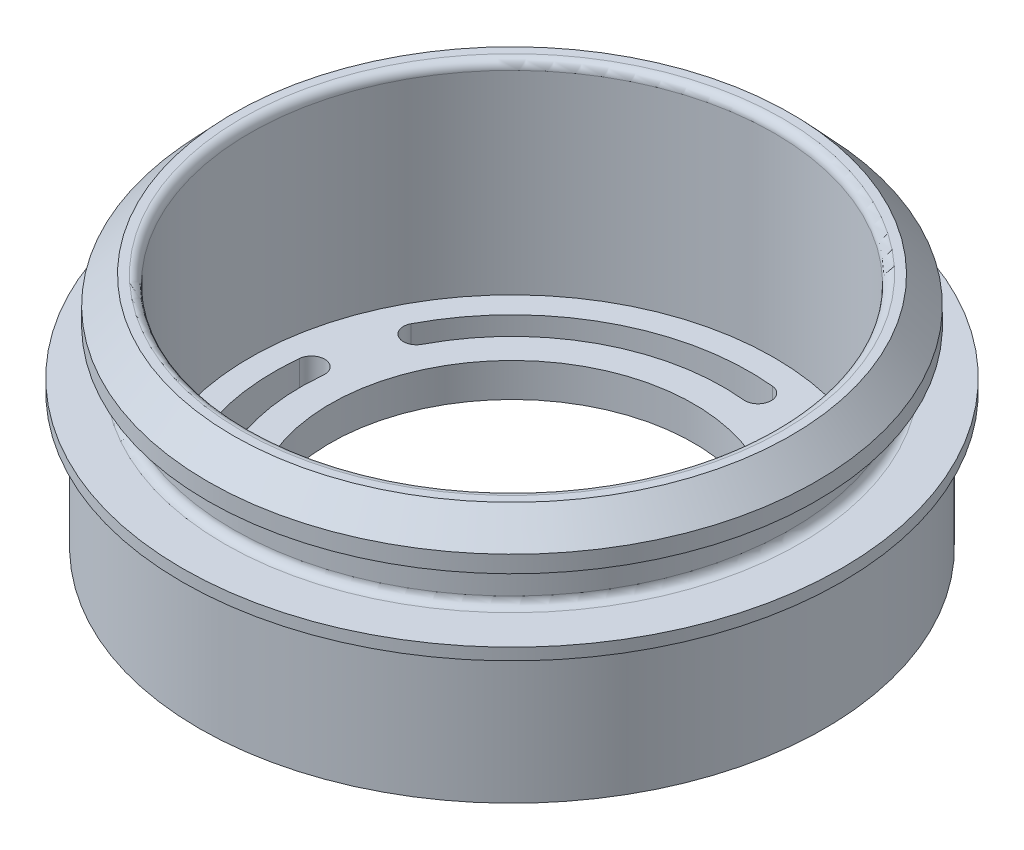
ISO-10303-21;
HEADER;
FILE_DESCRIPTION(('STEP AP214'),'2;1');
FILE_NAME('part.step','',(''),(''),'','','');
FILE_SCHEMA(('AUTOMOTIVE_DESIGN { 1 0 10303 214 1 1 1 1 }'));
ENDSEC;
DATA;
#1=APPLICATION_CONTEXT('core data for automotive mechanical design processes');
#2=APPLICATION_PROTOCOL_DEFINITION('international standard','automotive_design',2000,#1);
#3=PRODUCT_CONTEXT('',#1,'mechanical');
#4=PRODUCT('Part','Part','',(#3));
#5=PRODUCT_RELATED_PRODUCT_CATEGORY('part','',(#4));
#6=PRODUCT_DEFINITION_FORMATION('','',#4);
#7=PRODUCT_DEFINITION_CONTEXT('part definition',#1,'design');
#8=PRODUCT_DEFINITION('design','',#6,#7);
#9=PRODUCT_DEFINITION_SHAPE('','',#8);
#10=(LENGTH_UNIT() NAMED_UNIT(*) SI_UNIT(.MILLI.,.METRE.));
#11=(NAMED_UNIT(*) PLANE_ANGLE_UNIT() SI_UNIT($,.RADIAN.));
#12=(NAMED_UNIT(*) SI_UNIT($,.STERADIAN.) SOLID_ANGLE_UNIT());
#13=UNCERTAINTY_MEASURE_WITH_UNIT(LENGTH_MEASURE(1.E-05),#10,'distance_accuracy_value','');
#14=(GEOMETRIC_REPRESENTATION_CONTEXT(3) GLOBAL_UNCERTAINTY_ASSIGNED_CONTEXT((#13)) GLOBAL_UNIT_ASSIGNED_CONTEXT((#10,
#11,#12)) REPRESENTATION_CONTEXT('',''));
#15=CARTESIAN_POINT('',(0.,0.,0.));
#16=DIRECTION('',(0.,0.,1.));
#17=DIRECTION('',(1.,0.,0.));
#18=AXIS2_PLACEMENT_3D('',#15,#16,#17);
#19=CARTESIAN_POINT('',(0.,12.7,0.));
#20=DIRECTION('',(0.,1.,0.));
#21=DIRECTION('',(0.,0.,1.));
#22=AXIS2_PLACEMENT_3D('',#19,#20,#21);
#23=CYLINDRICAL_SURFACE('',#22,16.5);
#24=CARTESIAN_POINT('',(0.,7.2,0.));
#25=DIRECTION('',(0.,1.,0.));
#26=DIRECTION('',(0.,0.,1.));
#27=AXIS2_PLACEMENT_3D('',#24,#25,#26);
#28=CIRCLE('',#27,16.5);
#29=CARTESIAN_POINT('',(0.,7.2,16.5));
#30=VERTEX_POINT('',#29);
#31=EDGE_CURVE('E288',#30,#30,#28,.T.);
#32=ORIENTED_EDGE('',*,*,#31,.T.);
#33=EDGE_LOOP('',(#32));
#34=FACE_BOUND('',#33,.T.);
#35=CARTESIAN_POINT('',(0.,9.4,0.));
#36=DIRECTION('',(0.,1.,0.));
#37=DIRECTION('',(0.,0.,1.));
#38=AXIS2_PLACEMENT_3D('',#35,#36,#37);
#39=CIRCLE('',#38,16.5);
#40=CARTESIAN_POINT('',(0.,9.4,16.5));
#41=VERTEX_POINT('',#40);
#42=EDGE_CURVE('E13',#41,#41,#39,.T.);
#43=ORIENTED_EDGE('',*,*,#42,.F.);
#44=EDGE_LOOP('',(#43));
#45=FACE_BOUND('',#44,.T.);
#46=ADVANCED_FACE('F46',(#34,#45),#23,.T.);
#47=CARTESIAN_POINT('',(-16.5,9.4,0.));
#48=DIRECTION('',(0.,-1.,0.));
#49=DIRECTION('',(0.,0.,-1.));
#50=AXIS2_PLACEMENT_3D('',#47,#48,#49);
#51=PLANE('',#50);
#52=ORIENTED_EDGE('',*,*,#42,.T.);
#53=EDGE_LOOP('',(#52));
#54=FACE_BOUND('',#53,.T.);
#55=CARTESIAN_POINT('',(0.,9.4,0.));
#56=DIRECTION('',(0.,1.,0.));
#57=DIRECTION('',(0.,0.,1.));
#58=AXIS2_PLACEMENT_3D('',#55,#56,#57);
#59=CIRCLE('',#58,18.);
#60=CARTESIAN_POINT('',(0.,9.4,18.));
#61=VERTEX_POINT('',#60);
#62=EDGE_CURVE('E53',#61,#61,#59,.T.);
#63=ORIENTED_EDGE('',*,*,#62,.F.);
#64=EDGE_LOOP('',(#63));
#65=FACE_BOUND('',#64,.T.);
#66=ADVANCED_FACE('F332',(#54,#65),#51,.T.);
#67=CARTESIAN_POINT('',(0.,12.7,0.));
#68=DIRECTION('',(0.,1.,0.));
#69=DIRECTION('',(0.,0.,1.));
#70=AXIS2_PLACEMENT_3D('',#67,#68,#69);
#71=CYLINDRICAL_SURFACE('',#70,18.);
#72=ORIENTED_EDGE('',*,*,#62,.T.);
#73=EDGE_LOOP('',(#72));
#74=FACE_BOUND('',#73,.T.);
#75=CARTESIAN_POINT('',(0.,10.4,0.));
#76=DIRECTION('',(0.,1.,0.));
#77=DIRECTION('',(0.,0.,1.));
#78=AXIS2_PLACEMENT_3D('',#75,#76,#77);
#79=CIRCLE('',#78,18.);
#80=CARTESIAN_POINT('',(0.,10.4,18.));
#81=VERTEX_POINT('',#80);
#82=EDGE_CURVE('E324',#81,#81,#79,.T.);
#83=ORIENTED_EDGE('',*,*,#82,.F.);
#84=EDGE_LOOP('',(#83));
#85=FACE_BOUND('',#84,.T.);
#86=ADVANCED_FACE('F329',(#74,#85),#71,.T.);
#87=CARTESIAN_POINT('',(0.,12.,0.));
#88=DIRECTION('',(0.,-1.,0.));
#89=DIRECTION('',(0.,0.,-1.));
#90=AXIS2_PLACEMENT_3D('',#87,#88,#89);
#91=CONICAL_SURFACE('',#90,16.5,0.753151280962193);
#92=ORIENTED_EDGE('',*,*,#82,.T.);
#93=EDGE_LOOP('',(#92));
#94=FACE_BOUND('',#93,.T.);
#95=CARTESIAN_POINT('',(0.,12.,0.));
#96=DIRECTION('',(0.,1.,0.));
#97=DIRECTION('',(0.,0.,1.));
#98=AXIS2_PLACEMENT_3D('',#95,#96,#97);
#99=CIRCLE('',#98,16.5);
#100=CARTESIAN_POINT('',(0.,12.,16.5));
#101=VERTEX_POINT('',#100);
#102=EDGE_CURVE('E321',#101,#101,#99,.T.);
#103=ORIENTED_EDGE('',*,*,#102,.F.);
#104=EDGE_LOOP('',(#103));
#105=FACE_BOUND('',#104,.T.);
#106=ADVANCED_FACE('F339',(#94,#105),#91,.T.);
#107=CARTESIAN_POINT('',(-16.,12.,0.));
#108=DIRECTION('',(0.,1.,0.));
#109=DIRECTION('',(0.,0.,1.));
#110=AXIS2_PLACEMENT_3D('',#107,#108,#109);
#111=PLANE('',#110);
#112=ORIENTED_EDGE('',*,*,#102,.T.);
#113=EDGE_LOOP('',(#112));
#114=FACE_BOUND('',#113,.T.);
#115=CARTESIAN_POINT('',(0.,12.,0.));
#116=DIRECTION('',(0.,1.,0.));
#117=DIRECTION('',(0.,0.,1.));
#118=AXIS2_PLACEMENT_3D('',#115,#116,#117);
#119=CIRCLE('',#118,16.);
#120=CARTESIAN_POINT('',(0.,12.,16.));
#121=VERTEX_POINT('',#120);
#122=EDGE_CURVE('E318',#121,#121,#119,.T.);
#123=ORIENTED_EDGE('',*,*,#122,.F.);
#124=EDGE_LOOP('',(#123));
#125=FACE_BOUND('',#124,.T.);
#126=ADVANCED_FACE('F345',(#114,#125),#111,.T.);
#127=CARTESIAN_POINT('',(0.,11.5,0.));
#128=DIRECTION('',(0.,1.,0.));
#129=DIRECTION('',(0.,0.,1.));
#130=AXIS2_PLACEMENT_3D('',#127,#128,#129);
#131=TOROIDAL_SURFACE('',#130,16.,0.5);
#132=ORIENTED_EDGE('',*,*,#122,.T.);
#133=EDGE_LOOP('',(#132));
#134=FACE_BOUND('',#133,.T.);
#135=CARTESIAN_POINT('',(0.,11.5,0.));
#136=DIRECTION('',(0.,1.,0.));
#137=DIRECTION('',(0.,0.,1.));
#138=AXIS2_PLACEMENT_3D('',#135,#136,#137);
#139=CIRCLE('',#138,15.5);
#140=CARTESIAN_POINT('',(0.,11.5,15.5));
#141=VERTEX_POINT('',#140);
#142=EDGE_CURVE('E315',#141,#141,#139,.T.);
#143=ORIENTED_EDGE('',*,*,#142,.F.);
#144=EDGE_LOOP('',(#143));
#145=FACE_BOUND('',#144,.T.);
#146=ADVANCED_FACE('F349',(#134,#145),#131,.T.);
#147=CARTESIAN_POINT('',(0.,12.7,0.));
#148=DIRECTION('',(0.,1.,0.));
#149=DIRECTION('',(0.,0.,1.));
#150=AXIS2_PLACEMENT_3D('',#147,#148,#149);
#151=CYLINDRICAL_SURFACE('',#150,15.5);
#152=ORIENTED_EDGE('',*,*,#142,.T.);
#153=EDGE_LOOP('',(#152));
#154=FACE_BOUND('',#153,.T.);
#155=CARTESIAN_POINT('',(0.,0.,0.));
#156=DIRECTION('',(0.,1.,0.));
#157=DIRECTION('',(0.,0.,1.));
#158=AXIS2_PLACEMENT_3D('',#155,#156,#157);
#159=CIRCLE('',#158,15.5);
#160=CARTESIAN_POINT('',(0.,0.,15.5));
#161=VERTEX_POINT('',#160);
#162=EDGE_CURVE('E312',#161,#161,#159,.T.);
#163=ORIENTED_EDGE('',*,*,#162,.F.);
#164=EDGE_LOOP('',(#163));
#165=FACE_BOUND('',#164,.T.);
#166=ADVANCED_FACE('F353',(#154,#165),#151,.F.);
#167=CARTESIAN_POINT('',(-15.5,0.,0.));
#168=DIRECTION('',(0.,1.,0.));
#169=DIRECTION('',(0.,0.,1.));
#170=AXIS2_PLACEMENT_3D('',#167,#168,#169);
#171=PLANE('',#170);
#172=CARTESIAN_POINT('',(-1.34472367068549,0.,13.2067158389017));
#173=DIRECTION('',(0.,1.,0.));
#174=DIRECTION('',(0.,0.,1.));
#175=AXIS2_PLACEMENT_3D('',#172,#173,#174);
#176=CIRCLE('',#175,0.781889756117701);
#177=CARTESIAN_POINT('',(-1.26552023091766,0.,12.4288479800396));
#178=VERTEX_POINT('',#177);
#179=CARTESIAN_POINT('',(-1.42392711045332,0.,13.9845836977639));
#180=VERTEX_POINT('',#179);
#181=EDGE_CURVE('E60',#178,#180,#176,.T.);
#182=ORIENTED_EDGE('',*,*,#181,.F.);
#183=CARTESIAN_POINT('',(0.,0.,0.));
#184=DIRECTION('',(0.,-1.,0.));
#185=DIRECTION('',(0.,0.,1.));
#186=AXIS2_PLACEMENT_3D('',#183,#184,#185);
#187=CIRCLE('',#186,12.4931102438823);
#188=CARTESIAN_POINT('',(11.080601193577,0.,5.77044892141822));
#189=VERTEX_POINT('',#188);
#190=EDGE_CURVE('E170',#189,#178,#187,.T.);
#191=ORIENTED_EDGE('',*,*,#190,.F.);
#192=CARTESIAN_POINT('',(11.7740881152286,0.,6.13159637083473));
#193=DIRECTION('',(0.,1.,0.));
#194=DIRECTION('',(0.,0.,1.));
#195=AXIS2_PLACEMENT_3D('',#192,#193,#194);
#196=CIRCLE('',#195,0.781889756117699);
#197=CARTESIAN_POINT('',(12.4675750368801,0.,6.49274382025123));
#198=VERTEX_POINT('',#197);
#199=EDGE_CURVE('E184',#198,#189,#196,.T.);
#200=ORIENTED_EDGE('',*,*,#199,.F.);
#201=CARTESIAN_POINT('',(0.,0.,0.));
#202=DIRECTION('',(0.,1.,0.));
#203=DIRECTION('',(0.,0.,1.));
#204=AXIS2_PLACEMENT_3D('',#201,#202,#203);
#205=CIRCLE('',#204,14.0568897561177);
#206=EDGE_CURVE('E177',#180,#198,#205,.T.);
#207=ORIENTED_EDGE('',*,*,#206,.F.);
#208=EDGE_LOOP('',(#182,#191,#200,#207));
#209=FACE_BOUND('',#208,.T.);
#210=CARTESIAN_POINT('',(13.2067158389017,0.,1.34472367068549));
#211=DIRECTION('',(0.,1.,0.));
#212=DIRECTION('',(0.,0.,1.));
#213=AXIS2_PLACEMENT_3D('',#210,#211,#212);
#214=CIRCLE('',#213,0.781889756117701);
#215=CARTESIAN_POINT('',(12.4288479800396,0.,1.26552023091766));
#216=VERTEX_POINT('',#215);
#217=CARTESIAN_POINT('',(13.9845836977639,0.,1.42392711045332));
#218=VERTEX_POINT('',#217);
#219=EDGE_CURVE('E201',#216,#218,#214,.T.);
#220=ORIENTED_EDGE('',*,*,#219,.F.);
#221=CARTESIAN_POINT('',(0.,0.,0.));
#222=DIRECTION('',(0.,-1.,0.));
#223=DIRECTION('',(0.,0.,1.));
#224=AXIS2_PLACEMENT_3D('',#221,#222,#223);
#225=CIRCLE('',#224,12.4931102438823);
#226=CARTESIAN_POINT('',(5.77044892141822,0.,-11.080601193577));
#227=VERTEX_POINT('',#226);
#228=EDGE_CURVE('E209',#227,#216,#225,.T.);
#229=ORIENTED_EDGE('',*,*,#228,.F.);
#230=CARTESIAN_POINT('',(6.13159637083473,0.,-11.7740881152286));
#231=DIRECTION('',(0.,1.,0.));
#232=DIRECTION('',(0.,0.,1.));
#233=AXIS2_PLACEMENT_3D('',#230,#231,#232);
#234=CIRCLE('',#233,0.7818897561177);
#235=CARTESIAN_POINT('',(6.49274382025124,0.,-12.4675750368801));
#236=VERTEX_POINT('',#235);
#237=EDGE_CURVE('E206',#236,#227,#234,.T.);
#238=ORIENTED_EDGE('',*,*,#237,.F.);
#239=CARTESIAN_POINT('',(0.,0.,0.));
#240=DIRECTION('',(0.,1.,0.));
#241=DIRECTION('',(0.,0.,1.));
#242=AXIS2_PLACEMENT_3D('',#239,#240,#241);
#243=CIRCLE('',#242,14.0568897561177);
#244=EDGE_CURVE('E203',#218,#236,#243,.T.);
#245=ORIENTED_EDGE('',*,*,#244,.F.);
#246=EDGE_LOOP('',(#220,#229,#238,#245));
#247=FACE_BOUND('',#246,.T.);
#248=CARTESIAN_POINT('',(1.34472367068549,0.,-13.2067158389017));
#249=DIRECTION('',(0.,1.,0.));
#250=DIRECTION('',(0.,0.,1.));
#251=AXIS2_PLACEMENT_3D('',#248,#249,#250);
#252=CIRCLE('',#251,0.7818897561177);
#253=CARTESIAN_POINT('',(1.26552023091766,0.,-12.4288479800396));
#254=VERTEX_POINT('',#253);
#255=CARTESIAN_POINT('',(1.42392711045332,0.,-13.9845836977639));
#256=VERTEX_POINT('',#255);
#257=EDGE_CURVE('E233',#254,#256,#252,.T.);
#258=ORIENTED_EDGE('',*,*,#257,.F.);
#259=CARTESIAN_POINT('',(0.,0.,0.));
#260=DIRECTION('',(0.,-1.,0.));
#261=DIRECTION('',(0.,0.,1.));
#262=AXIS2_PLACEMENT_3D('',#259,#260,#261);
#263=CIRCLE('',#262,12.4931102438823);
#264=CARTESIAN_POINT('',(-11.080601193577,0.,-5.77044892141823));
#265=VERTEX_POINT('',#264);
#266=EDGE_CURVE('E241',#265,#254,#263,.T.);
#267=ORIENTED_EDGE('',*,*,#266,.F.);
#268=CARTESIAN_POINT('',(-11.7740881152286,0.,-6.13159637083473));
#269=DIRECTION('',(0.,1.,0.));
#270=DIRECTION('',(0.,0.,1.));
#271=AXIS2_PLACEMENT_3D('',#268,#269,#270);
#272=CIRCLE('',#271,0.781889756117699);
#273=CARTESIAN_POINT('',(-12.4675750368801,0.,-6.49274382025124));
#274=VERTEX_POINT('',#273);
#275=EDGE_CURVE('E238',#274,#265,#272,.T.);
#276=ORIENTED_EDGE('',*,*,#275,.F.);
#277=CARTESIAN_POINT('',(0.,0.,0.));
#278=DIRECTION('',(0.,1.,0.));
#279=DIRECTION('',(0.,0.,1.));
#280=AXIS2_PLACEMENT_3D('',#277,#278,#279);
#281=CIRCLE('',#280,14.0568897561177);
#282=EDGE_CURVE('E235',#256,#274,#281,.T.);
#283=ORIENTED_EDGE('',*,*,#282,.F.);
#284=EDGE_LOOP('',(#258,#267,#276,#283));
#285=FACE_BOUND('',#284,.T.);
#286=CARTESIAN_POINT('',(-13.2067158389017,0.,-1.34472367068549));
#287=DIRECTION('',(0.,1.,0.));
#288=DIRECTION('',(0.,0.,1.));
#289=AXIS2_PLACEMENT_3D('',#286,#287,#288);
#290=CIRCLE('',#289,0.781889756117701);
#291=CARTESIAN_POINT('',(-12.4288479800396,0.,-1.26552023091765));
#292=VERTEX_POINT('',#291);
#293=CARTESIAN_POINT('',(-13.9845836977639,0.,-1.42392711045332));
#294=VERTEX_POINT('',#293);
#295=EDGE_CURVE('E265',#292,#294,#290,.T.);
#296=ORIENTED_EDGE('',*,*,#295,.F.);
#297=CARTESIAN_POINT('',(0.,0.,0.));
#298=DIRECTION('',(0.,-1.,0.));
#299=DIRECTION('',(0.,0.,1.));
#300=AXIS2_PLACEMENT_3D('',#297,#298,#299);
#301=CIRCLE('',#300,12.4931102438823);
#302=CARTESIAN_POINT('',(-5.77044892141822,0.,11.080601193577));
#303=VERTEX_POINT('',#302);
#304=EDGE_CURVE('E273',#303,#292,#301,.T.);
#305=ORIENTED_EDGE('',*,*,#304,.F.);
#306=CARTESIAN_POINT('',(-6.13159637083473,0.,11.7740881152286));
#307=DIRECTION('',(0.,1.,0.));
#308=DIRECTION('',(0.,0.,1.));
#309=AXIS2_PLACEMENT_3D('',#306,#307,#308);
#310=CIRCLE('',#309,0.7818897561177);
#311=CARTESIAN_POINT('',(-6.49274382025124,0.,12.4675750368801));
#312=VERTEX_POINT('',#311);
#313=EDGE_CURVE('E270',#312,#303,#310,.T.);
#314=ORIENTED_EDGE('',*,*,#313,.F.);
#315=CARTESIAN_POINT('',(0.,0.,0.));
#316=DIRECTION('',(0.,1.,0.));
#317=DIRECTION('',(0.,0.,1.));
#318=AXIS2_PLACEMENT_3D('',#315,#316,#317);
#319=CIRCLE('',#318,14.0568897561177);
#320=EDGE_CURVE('E267',#294,#312,#319,.T.);
#321=ORIENTED_EDGE('',*,*,#320,.F.);
#322=EDGE_LOOP('',(#296,#305,#314,#321));
#323=FACE_BOUND('',#322,.T.);
#324=ORIENTED_EDGE('',*,*,#162,.T.);
#325=EDGE_LOOP('',(#324));
#326=FACE_BOUND('',#325,.T.);
#327=CARTESIAN_POINT('',(0.,0.,0.));
#328=DIRECTION('',(0.,1.,0.));
#329=DIRECTION('',(0.,0.,1.));
#330=AXIS2_PLACEMENT_3D('',#327,#328,#329);
#331=CIRCLE('',#330,10.75);
#332=CARTESIAN_POINT('',(0.,0.,10.75));
#333=VERTEX_POINT('',#332);
#334=EDGE_CURVE('E309',#333,#333,#331,.T.);
#335=ORIENTED_EDGE('',*,*,#334,.F.);
#336=EDGE_LOOP('',(#335));
#337=FACE_BOUND('',#336,.T.);
#338=ADVANCED_FACE('F357',(#209,#247,#285,#323,#326,#337),#171,.T.);
#339=CARTESIAN_POINT('',(0.,12.7,0.));
#340=DIRECTION('',(0.,1.,0.));
#341=DIRECTION('',(0.,0.,1.));
#342=AXIS2_PLACEMENT_3D('',#339,#340,#341);
#343=CYLINDRICAL_SURFACE('',#342,10.75);
#344=ORIENTED_EDGE('',*,*,#334,.T.);
#345=EDGE_LOOP('',(#344));
#346=FACE_BOUND('',#345,.T.);
#347=CARTESIAN_POINT('',(0.,-2.,0.));
#348=DIRECTION('',(0.,1.,0.));
#349=DIRECTION('',(0.,0.,1.));
#350=AXIS2_PLACEMENT_3D('',#347,#348,#349);
#351=CIRCLE('',#350,10.75);
#352=CARTESIAN_POINT('',(0.,-2.,10.75));
#353=VERTEX_POINT('',#352);
#354=EDGE_CURVE('E306',#353,#353,#351,.T.);
#355=ORIENTED_EDGE('',*,*,#354,.F.);
#356=EDGE_LOOP('',(#355));
#357=FACE_BOUND('',#356,.T.);
#358=ADVANCED_FACE('F361',(#346,#357),#343,.F.);
#359=CARTESIAN_POINT('',(-10.75,-2.,0.));
#360=DIRECTION('',(0.,-1.,0.));
#361=DIRECTION('',(0.,0.,-1.));
#362=AXIS2_PLACEMENT_3D('',#359,#360,#361);
#363=PLANE('',#362);
#364=CARTESIAN_POINT('',(-1.34472367068549,-2.,13.2067158389017));
#365=DIRECTION('',(0.,-1.,0.));
#366=DIRECTION('',(0.,0.,-1.));
#367=AXIS2_PLACEMENT_3D('',#364,#365,#366);
#368=CIRCLE('',#367,0.781889756117701);
#369=CARTESIAN_POINT('',(-1.26552023091766,-2.,12.4288479800396));
#370=VERTEX_POINT('',#369);
#371=CARTESIAN_POINT('',(-1.42392711045332,-2.,13.9845836977639));
#372=VERTEX_POINT('',#371);
#373=EDGE_CURVE('E168',#370,#372,#368,.F.);
#374=ORIENTED_EDGE('',*,*,#373,.T.);
#375=CARTESIAN_POINT('',(0.,-2.,0.));
#376=DIRECTION('',(0.,-1.,0.));
#377=DIRECTION('',(0.,0.,-1.));
#378=AXIS2_PLACEMENT_3D('',#375,#376,#377);
#379=CIRCLE('',#378,14.0568897561177);
#380=CARTESIAN_POINT('',(12.4675750368801,-2.,6.49274382025123));
#381=VERTEX_POINT('',#380);
#382=EDGE_CURVE('E157',#372,#381,#379,.F.);
#383=ORIENTED_EDGE('',*,*,#382,.T.);
#384=CARTESIAN_POINT('',(11.7740881152286,-2.,6.13159637083473));
#385=DIRECTION('',(0.,-1.,0.));
#386=DIRECTION('',(0.,0.,-1.));
#387=AXIS2_PLACEMENT_3D('',#384,#385,#386);
#388=CIRCLE('',#387,0.781889756117699);
#389=CARTESIAN_POINT('',(11.080601193577,-2.,5.77044892141822));
#390=VERTEX_POINT('',#389);
#391=EDGE_CURVE('E179',#381,#390,#388,.F.);
#392=ORIENTED_EDGE('',*,*,#391,.T.);
#393=CARTESIAN_POINT('',(0.,-2.,0.));
#394=DIRECTION('',(0.,-1.,0.));
#395=DIRECTION('',(0.,0.,-1.));
#396=AXIS2_PLACEMENT_3D('',#393,#394,#395);
#397=CIRCLE('',#396,12.4931102438823);
#398=EDGE_CURVE('E175',#390,#370,#397,.T.);
#399=ORIENTED_EDGE('',*,*,#398,.T.);
#400=EDGE_LOOP('',(#374,#383,#392,#399));
#401=FACE_BOUND('',#400,.T.);
#402=CARTESIAN_POINT('',(13.2067158389017,-2.,1.34472367068549));
#403=DIRECTION('',(0.,-1.,0.));
#404=DIRECTION('',(0.,0.,-1.));
#405=AXIS2_PLACEMENT_3D('',#402,#403,#404);
#406=CIRCLE('',#405,0.781889756117701);
#407=CARTESIAN_POINT('',(12.4288479800396,-2.,1.26552023091766));
#408=VERTEX_POINT('',#407);
#409=CARTESIAN_POINT('',(13.9845836977639,-2.,1.42392711045332));
#410=VERTEX_POINT('',#409);
#411=EDGE_CURVE('E198',#408,#410,#406,.F.);
#412=ORIENTED_EDGE('',*,*,#411,.T.);
#413=CARTESIAN_POINT('',(0.,-2.,0.));
#414=DIRECTION('',(0.,-1.,0.));
#415=DIRECTION('',(0.,0.,-1.));
#416=AXIS2_PLACEMENT_3D('',#413,#414,#415);
#417=CIRCLE('',#416,14.0568897561177);
#418=CARTESIAN_POINT('',(6.49274382025124,-2.,-12.4675750368801));
#419=VERTEX_POINT('',#418);
#420=EDGE_CURVE('E215',#410,#419,#417,.F.);
#421=ORIENTED_EDGE('',*,*,#420,.T.);
#422=CARTESIAN_POINT('',(6.13159637083473,-2.,-11.7740881152286));
#423=DIRECTION('',(0.,-1.,0.));
#424=DIRECTION('',(0.,0.,-1.));
#425=AXIS2_PLACEMENT_3D('',#422,#423,#424);
#426=CIRCLE('',#425,0.7818897561177);
#427=CARTESIAN_POINT('',(5.77044892141822,-2.,-11.080601193577));
#428=VERTEX_POINT('',#427);
#429=EDGE_CURVE('E164',#419,#428,#426,.F.);
#430=ORIENTED_EDGE('',*,*,#429,.T.);
#431=CARTESIAN_POINT('',(0.,-2.,0.));
#432=DIRECTION('',(0.,-1.,0.));
#433=DIRECTION('',(0.,0.,-1.));
#434=AXIS2_PLACEMENT_3D('',#431,#432,#433);
#435=CIRCLE('',#434,12.4931102438823);
#436=EDGE_CURVE('E195',#428,#408,#435,.T.);
#437=ORIENTED_EDGE('',*,*,#436,.T.);
#438=EDGE_LOOP('',(#412,#421,#430,#437));
#439=FACE_BOUND('',#438,.T.);
#440=CARTESIAN_POINT('',(1.34472367068549,-2.,-13.2067158389017));
#441=DIRECTION('',(0.,-1.,0.));
#442=DIRECTION('',(0.,0.,-1.));
#443=AXIS2_PLACEMENT_3D('',#440,#441,#442);
#444=CIRCLE('',#443,0.7818897561177);
#445=CARTESIAN_POINT('',(1.26552023091766,-2.,-12.4288479800396));
#446=VERTEX_POINT('',#445);
#447=CARTESIAN_POINT('',(1.42392711045332,-2.,-13.9845836977639));
#448=VERTEX_POINT('',#447);
#449=EDGE_CURVE('E230',#446,#448,#444,.F.);
#450=ORIENTED_EDGE('',*,*,#449,.T.);
#451=CARTESIAN_POINT('',(0.,-2.,0.));
#452=DIRECTION('',(0.,-1.,0.));
#453=DIRECTION('',(0.,0.,-1.));
#454=AXIS2_PLACEMENT_3D('',#451,#452,#453);
#455=CIRCLE('',#454,14.0568897561177);
#456=CARTESIAN_POINT('',(-12.4675750368801,-2.,-6.49274382025124));
#457=VERTEX_POINT('',#456);
#458=EDGE_CURVE('E247',#448,#457,#455,.F.);
#459=ORIENTED_EDGE('',*,*,#458,.T.);
#460=CARTESIAN_POINT('',(-11.7740881152286,-2.,-6.13159637083473));
#461=DIRECTION('',(0.,-1.,0.));
#462=DIRECTION('',(0.,0.,-1.));
#463=AXIS2_PLACEMENT_3D('',#460,#461,#462);
#464=CIRCLE('',#463,0.781889756117699);
#465=CARTESIAN_POINT('',(-11.080601193577,-2.,-5.77044892141823));
#466=VERTEX_POINT('',#465);
#467=EDGE_CURVE('E224',#457,#466,#464,.F.);
#468=ORIENTED_EDGE('',*,*,#467,.T.);
#469=CARTESIAN_POINT('',(0.,-2.,0.));
#470=DIRECTION('',(0.,-1.,0.));
#471=DIRECTION('',(0.,0.,-1.));
#472=AXIS2_PLACEMENT_3D('',#469,#470,#471);
#473=CIRCLE('',#472,12.4931102438823);
#474=EDGE_CURVE('E227',#466,#446,#473,.T.);
#475=ORIENTED_EDGE('',*,*,#474,.T.);
#476=EDGE_LOOP('',(#450,#459,#468,#475));
#477=FACE_BOUND('',#476,.T.);
#478=CARTESIAN_POINT('',(-13.2067158389017,-2.,-1.34472367068549));
#479=DIRECTION('',(0.,-1.,0.));
#480=DIRECTION('',(0.,0.,-1.));
#481=AXIS2_PLACEMENT_3D('',#478,#479,#480);
#482=CIRCLE('',#481,0.781889756117701);
#483=CARTESIAN_POINT('',(-12.4288479800396,-2.,-1.26552023091765));
#484=VERTEX_POINT('',#483);
#485=CARTESIAN_POINT('',(-13.9845836977639,-2.,-1.42392711045332));
#486=VERTEX_POINT('',#485);
#487=EDGE_CURVE('E262',#484,#486,#482,.F.);
#488=ORIENTED_EDGE('',*,*,#487,.T.);
#489=CARTESIAN_POINT('',(0.,-2.,0.));
#490=DIRECTION('',(0.,-1.,0.));
#491=DIRECTION('',(0.,0.,-1.));
#492=AXIS2_PLACEMENT_3D('',#489,#490,#491);
#493=CIRCLE('',#492,14.0568897561177);
#494=CARTESIAN_POINT('',(-6.49274382025124,-2.,12.4675750368801));
#495=VERTEX_POINT('',#494);
#496=EDGE_CURVE('E279',#486,#495,#493,.F.);
#497=ORIENTED_EDGE('',*,*,#496,.T.);
#498=CARTESIAN_POINT('',(-6.13159637083473,-2.,11.7740881152286));
#499=DIRECTION('',(0.,-1.,0.));
#500=DIRECTION('',(0.,0.,-1.));
#501=AXIS2_PLACEMENT_3D('',#498,#499,#500);
#502=CIRCLE('',#501,0.7818897561177);
#503=CARTESIAN_POINT('',(-5.77044892141822,-2.,11.080601193577));
#504=VERTEX_POINT('',#503);
#505=EDGE_CURVE('E256',#495,#504,#502,.F.);
#506=ORIENTED_EDGE('',*,*,#505,.T.);
#507=CARTESIAN_POINT('',(0.,-2.,0.));
#508=DIRECTION('',(0.,-1.,0.));
#509=DIRECTION('',(0.,0.,-1.));
#510=AXIS2_PLACEMENT_3D('',#507,#508,#509);
#511=CIRCLE('',#510,12.4931102438823);
#512=EDGE_CURVE('E259',#504,#484,#511,.T.);
#513=ORIENTED_EDGE('',*,*,#512,.T.);
#514=EDGE_LOOP('',(#488,#497,#506,#513));
#515=FACE_BOUND('',#514,.T.);
#516=ORIENTED_EDGE('',*,*,#354,.T.);
#517=EDGE_LOOP('',(#516));
#518=FACE_BOUND('',#517,.T.);
#519=CARTESIAN_POINT('',(0.,-2.,0.));
#520=DIRECTION('',(0.,1.,0.));
#521=DIRECTION('',(0.,0.,1.));
#522=AXIS2_PLACEMENT_3D('',#519,#520,#521);
#523=CIRCLE('',#522,18.5);
#524=CARTESIAN_POINT('',(0.,-2.,18.5));
#525=VERTEX_POINT('',#524);
#526=EDGE_CURVE('E303',#525,#525,#523,.T.);
#527=ORIENTED_EDGE('',*,*,#526,.F.);
#528=EDGE_LOOP('',(#527));
#529=FACE_BOUND('',#528,.T.);
#530=ADVANCED_FACE('F173',(#401,#439,#477,#515,#518,#529),#363,.T.);
#531=CARTESIAN_POINT('',(0.,12.7,0.));
#532=DIRECTION('',(0.,1.,0.));
#533=DIRECTION('',(0.,0.,1.));
#534=AXIS2_PLACEMENT_3D('',#531,#532,#533);
#535=CYLINDRICAL_SURFACE('',#534,18.5);
#536=ORIENTED_EDGE('',*,*,#526,.T.);
#537=EDGE_LOOP('',(#536));
#538=FACE_BOUND('',#537,.T.);
#539=CARTESIAN_POINT('',(0.,6.,0.));
#540=DIRECTION('',(0.,1.,0.));
#541=DIRECTION('',(0.,0.,1.));
#542=AXIS2_PLACEMENT_3D('',#539,#540,#541);
#543=CIRCLE('',#542,18.5);
#544=CARTESIAN_POINT('',(0.,6.,18.5));
#545=VERTEX_POINT('',#544);
#546=EDGE_CURVE('E300',#545,#545,#543,.T.);
#547=ORIENTED_EDGE('',*,*,#546,.F.);
#548=EDGE_LOOP('',(#547));
#549=FACE_BOUND('',#548,.T.);
#550=ADVANCED_FACE('F368',(#538,#549),#535,.T.);
#551=CARTESIAN_POINT('',(-19.5,6.,0.));
#552=DIRECTION('',(0.,-1.,0.));
#553=DIRECTION('',(0.,0.,-1.));
#554=AXIS2_PLACEMENT_3D('',#551,#552,#553);
#555=PLANE('',#554);
#556=ORIENTED_EDGE('',*,*,#546,.T.);
#557=EDGE_LOOP('',(#556));
#558=FACE_BOUND('',#557,.T.);
#559=CARTESIAN_POINT('',(0.,6.,0.));
#560=DIRECTION('',(0.,1.,0.));
#561=DIRECTION('',(0.,0.,1.));
#562=AXIS2_PLACEMENT_3D('',#559,#560,#561);
#563=CIRCLE('',#562,19.5);
#564=CARTESIAN_POINT('',(0.,6.,19.5));
#565=VERTEX_POINT('',#564);
#566=EDGE_CURVE('E297',#565,#565,#563,.T.);
#567=ORIENTED_EDGE('',*,*,#566,.F.);
#568=EDGE_LOOP('',(#567));
#569=FACE_BOUND('',#568,.T.);
#570=ADVANCED_FACE('F371',(#558,#569),#555,.T.);
#571=CARTESIAN_POINT('',(0.,12.7,0.));
#572=DIRECTION('',(0.,1.,0.));
#573=DIRECTION('',(0.,0.,1.));
#574=AXIS2_PLACEMENT_3D('',#571,#572,#573);
#575=CYLINDRICAL_SURFACE('',#574,19.5);
#576=ORIENTED_EDGE('',*,*,#566,.T.);
#577=EDGE_LOOP('',(#576));
#578=FACE_BOUND('',#577,.T.);
#579=CARTESIAN_POINT('',(0.,6.7,0.));
#580=DIRECTION('',(0.,1.,0.));
#581=DIRECTION('',(0.,0.,1.));
#582=AXIS2_PLACEMENT_3D('',#579,#580,#581);
#583=CIRCLE('',#582,19.5);
#584=CARTESIAN_POINT('',(0.,6.7,19.5));
#585=VERTEX_POINT('',#584);
#586=EDGE_CURVE('E294',#585,#585,#583,.T.);
#587=ORIENTED_EDGE('',*,*,#586,.F.);
#588=EDGE_LOOP('',(#587));
#589=FACE_BOUND('',#588,.T.);
#590=ADVANCED_FACE('F375',(#578,#589),#575,.T.);
#591=CARTESIAN_POINT('',(-17.,6.7,0.));
#592=DIRECTION('',(0.,1.,0.));
#593=DIRECTION('',(0.,0.,1.));
#594=AXIS2_PLACEMENT_3D('',#591,#592,#593);
#595=PLANE('',#594);
#596=ORIENTED_EDGE('',*,*,#586,.T.);
#597=EDGE_LOOP('',(#596));
#598=FACE_BOUND('',#597,.T.);
#599=CARTESIAN_POINT('',(0.,6.7,0.));
#600=DIRECTION('',(0.,1.,0.));
#601=DIRECTION('',(0.,0.,1.));
#602=AXIS2_PLACEMENT_3D('',#599,#600,#601);
#603=CIRCLE('',#602,17.);
#604=CARTESIAN_POINT('',(0.,6.7,17.));
#605=VERTEX_POINT('',#604);
#606=EDGE_CURVE('E291',#605,#605,#603,.T.);
#607=ORIENTED_EDGE('',*,*,#606,.F.);
#608=EDGE_LOOP('',(#607));
#609=FACE_BOUND('',#608,.T.);
#610=ADVANCED_FACE('F379',(#598,#609),#595,.T.);
#611=CARTESIAN_POINT('',(0.,7.2,0.));
#612=DIRECTION('',(0.,1.,0.));
#613=DIRECTION('',(0.,0.,1.));
#614=AXIS2_PLACEMENT_3D('',#611,#612,#613);
#615=TOROIDAL_SURFACE('',#614,17.,0.5);
#616=ORIENTED_EDGE('',*,*,#606,.T.);
#617=EDGE_LOOP('',(#616));
#618=FACE_BOUND('',#617,.T.);
#619=ORIENTED_EDGE('',*,*,#31,.F.);
#620=EDGE_LOOP('',(#619));
#621=FACE_BOUND('',#620,.T.);
#622=ADVANCED_FACE('F383',(#618,#621),#615,.F.);
#623=CARTESIAN_POINT('',(-13.2067158389017,-2.001,-1.34472367068549));
#624=DIRECTION('',(0.,1.,0.));
#625=DIRECTION('',(0.,0.,1.));
#626=AXIS2_PLACEMENT_3D('',#623,#624,#625);
#627=CYLINDRICAL_SURFACE('',#626,0.781889756117701);
#628=DIRECTION('',(0.,1.,0.));
#629=VECTOR('',#628,1.);
#630=CARTESIAN_POINT('',(-12.4288479800396,-2.001,-1.26552023091765));
#631=LINE('',#630,#629);
#632=EDGE_CURVE('E277',#484,#292,#631,.T.);
#633=ORIENTED_EDGE('',*,*,#632,.T.);
#634=ORIENTED_EDGE('',*,*,#295,.T.);
#635=DIRECTION('',(0.,1.,0.));
#636=VECTOR('',#635,1.);
#637=CARTESIAN_POINT('',(-13.9845836977639,-2.001,-1.42392711045332));
#638=LINE('',#637,#636);
#639=EDGE_CURVE('E276',#486,#294,#638,.T.);
#640=ORIENTED_EDGE('',*,*,#639,.F.);
#641=ORIENTED_EDGE('',*,*,#487,.F.);
#642=EDGE_LOOP('',(#633,#634,#640,#641));
#643=FACE_BOUND('',#642,.T.);
#644=ADVANCED_FACE('F387',(#643),#627,.F.);
#645=CARTESIAN_POINT('',(0.,-2.001,0.));
#646=DIRECTION('',(0.,1.,0.));
#647=DIRECTION('',(0.,0.,1.));
#648=AXIS2_PLACEMENT_3D('',#645,#646,#647);
#649=CYLINDRICAL_SURFACE('',#648,12.4931102438823);
#650=DIRECTION('',(0.,1.,0.));
#651=VECTOR('',#650,1.);
#652=CARTESIAN_POINT('',(-5.77044892141822,-2.001,11.080601193577));
#653=LINE('',#652,#651);
#654=EDGE_CURVE('E280',#504,#303,#653,.T.);
#655=ORIENTED_EDGE('',*,*,#654,.T.);
#656=ORIENTED_EDGE('',*,*,#304,.T.);
#657=ORIENTED_EDGE('',*,*,#632,.F.);
#658=ORIENTED_EDGE('',*,*,#512,.F.);
#659=EDGE_LOOP('',(#655,#656,#657,#658));
#660=FACE_BOUND('',#659,.T.);
#661=ADVANCED_FACE('F391',(#660),#649,.T.);
#662=CARTESIAN_POINT('',(-6.13159637083473,-2.001,11.7740881152286));
#663=DIRECTION('',(0.,1.,0.));
#664=DIRECTION('',(0.,0.,1.));
#665=AXIS2_PLACEMENT_3D('',#662,#663,#664);
#666=CYLINDRICAL_SURFACE('',#665,0.7818897561177);
#667=DIRECTION('',(0.,1.,0.));
#668=VECTOR('',#667,1.);
#669=CARTESIAN_POINT('',(-6.49274382025124,-2.001,12.4675750368801));
#670=LINE('',#669,#668);
#671=EDGE_CURVE('E282',#495,#312,#670,.T.);
#672=ORIENTED_EDGE('',*,*,#671,.T.);
#673=ORIENTED_EDGE('',*,*,#313,.T.);
#674=ORIENTED_EDGE('',*,*,#654,.F.);
#675=ORIENTED_EDGE('',*,*,#505,.F.);
#676=EDGE_LOOP('',(#672,#673,#674,#675));
#677=FACE_BOUND('',#676,.T.);
#678=ADVANCED_FACE('F397',(#677),#666,.F.);
#679=CARTESIAN_POINT('',(0.,-2.001,0.));
#680=DIRECTION('',(0.,1.,0.));
#681=DIRECTION('',(0.,0.,1.));
#682=AXIS2_PLACEMENT_3D('',#679,#680,#681);
#683=CYLINDRICAL_SURFACE('',#682,14.0568897561177);
#684=ORIENTED_EDGE('',*,*,#639,.T.);
#685=ORIENTED_EDGE('',*,*,#320,.T.);
#686=ORIENTED_EDGE('',*,*,#671,.F.);
#687=ORIENTED_EDGE('',*,*,#496,.F.);
#688=EDGE_LOOP('',(#684,#685,#686,#687));
#689=FACE_BOUND('',#688,.T.);
#690=ADVANCED_FACE('F393',(#689),#683,.F.);
#691=CARTESIAN_POINT('',(1.34472367068549,-2.001,-13.2067158389017));
#692=DIRECTION('',(0.,1.,0.));
#693=DIRECTION('',(0.,0.,1.));
#694=AXIS2_PLACEMENT_3D('',#691,#692,#693);
#695=CYLINDRICAL_SURFACE('',#694,0.7818897561177);
#696=DIRECTION('',(0.,1.,0.));
#697=VECTOR('',#696,1.);
#698=CARTESIAN_POINT('',(1.26552023091766,-2.001,-12.4288479800396));
#699=LINE('',#698,#697);
#700=EDGE_CURVE('E245',#446,#254,#699,.T.);
#701=ORIENTED_EDGE('',*,*,#700,.T.);
#702=ORIENTED_EDGE('',*,*,#257,.T.);
#703=DIRECTION('',(0.,1.,0.));
#704=VECTOR('',#703,1.);
#705=CARTESIAN_POINT('',(1.42392711045332,-2.001,-13.9845836977639));
#706=LINE('',#705,#704);
#707=EDGE_CURVE('E244',#448,#256,#706,.T.);
#708=ORIENTED_EDGE('',*,*,#707,.F.);
#709=ORIENTED_EDGE('',*,*,#449,.F.);
#710=EDGE_LOOP('',(#701,#702,#708,#709));
#711=FACE_BOUND('',#710,.T.);
#712=ADVANCED_FACE('F396',(#711),#695,.F.);
#713=CARTESIAN_POINT('',(0.,-2.001,0.));
#714=DIRECTION('',(0.,1.,0.));
#715=DIRECTION('',(0.,0.,1.));
#716=AXIS2_PLACEMENT_3D('',#713,#714,#715);
#717=CYLINDRICAL_SURFACE('',#716,12.4931102438823);
#718=DIRECTION('',(0.,1.,0.));
#719=VECTOR('',#718,1.);
#720=CARTESIAN_POINT('',(-11.080601193577,-2.001,-5.77044892141823));
#721=LINE('',#720,#719);
#722=EDGE_CURVE('E248',#466,#265,#721,.T.);
#723=ORIENTED_EDGE('',*,*,#722,.T.);
#724=ORIENTED_EDGE('',*,*,#266,.T.);
#725=ORIENTED_EDGE('',*,*,#700,.F.);
#726=ORIENTED_EDGE('',*,*,#474,.F.);
#727=EDGE_LOOP('',(#723,#724,#725,#726));
#728=FACE_BOUND('',#727,.T.);
#729=ADVANCED_FACE('F407',(#728),#717,.T.);
#730=CARTESIAN_POINT('',(-11.7740881152286,-2.001,-6.13159637083473));
#731=DIRECTION('',(0.,1.,0.));
#732=DIRECTION('',(0.,0.,1.));
#733=AXIS2_PLACEMENT_3D('',#730,#731,#732);
#734=CYLINDRICAL_SURFACE('',#733,0.781889756117699);
#735=DIRECTION('',(0.,1.,0.));
#736=VECTOR('',#735,1.);
#737=CARTESIAN_POINT('',(-12.4675750368801,-2.001,-6.49274382025124));
#738=LINE('',#737,#736);
#739=EDGE_CURVE('E250',#457,#274,#738,.T.);
#740=ORIENTED_EDGE('',*,*,#739,.T.);
#741=ORIENTED_EDGE('',*,*,#275,.T.);
#742=ORIENTED_EDGE('',*,*,#722,.F.);
#743=ORIENTED_EDGE('',*,*,#467,.F.);
#744=EDGE_LOOP('',(#740,#741,#742,#743));
#745=FACE_BOUND('',#744,.T.);
#746=ADVANCED_FACE('F413',(#745),#734,.F.);
#747=CARTESIAN_POINT('',(0.,-2.001,0.));
#748=DIRECTION('',(0.,1.,0.));
#749=DIRECTION('',(0.,0.,1.));
#750=AXIS2_PLACEMENT_3D('',#747,#748,#749);
#751=CYLINDRICAL_SURFACE('',#750,14.0568897561177);
#752=ORIENTED_EDGE('',*,*,#707,.T.);
#753=ORIENTED_EDGE('',*,*,#282,.T.);
#754=ORIENTED_EDGE('',*,*,#739,.F.);
#755=ORIENTED_EDGE('',*,*,#458,.F.);
#756=EDGE_LOOP('',(#752,#753,#754,#755));
#757=FACE_BOUND('',#756,.T.);
#758=ADVANCED_FACE('F409',(#757),#751,.F.);
#759=CARTESIAN_POINT('',(13.2067158389017,-2.001,1.34472367068549));
#760=DIRECTION('',(0.,1.,0.));
#761=DIRECTION('',(0.,0.,1.));
#762=AXIS2_PLACEMENT_3D('',#759,#760,#761);
#763=CYLINDRICAL_SURFACE('',#762,0.781889756117701);
#764=DIRECTION('',(0.,1.,0.));
#765=VECTOR('',#764,1.);
#766=CARTESIAN_POINT('',(12.4288479800396,-2.001,1.26552023091766));
#767=LINE('',#766,#765);
#768=EDGE_CURVE('E213',#408,#216,#767,.T.);
#769=ORIENTED_EDGE('',*,*,#768,.T.);
#770=ORIENTED_EDGE('',*,*,#219,.T.);
#771=DIRECTION('',(0.,1.,0.));
#772=VECTOR('',#771,1.);
#773=CARTESIAN_POINT('',(13.9845836977639,-2.001,1.42392711045332));
#774=LINE('',#773,#772);
#775=EDGE_CURVE('E212',#410,#218,#774,.T.);
#776=ORIENTED_EDGE('',*,*,#775,.F.);
#777=ORIENTED_EDGE('',*,*,#411,.F.);
#778=EDGE_LOOP('',(#769,#770,#776,#777));
#779=FACE_BOUND('',#778,.T.);
#780=ADVANCED_FACE('F412',(#779),#763,.F.);
#781=CARTESIAN_POINT('',(0.,-2.001,0.));
#782=DIRECTION('',(0.,1.,0.));
#783=DIRECTION('',(0.,0.,1.));
#784=AXIS2_PLACEMENT_3D('',#781,#782,#783);
#785=CYLINDRICAL_SURFACE('',#784,12.4931102438823);
#786=DIRECTION('',(0.,1.,0.));
#787=VECTOR('',#786,1.);
#788=CARTESIAN_POINT('',(5.77044892141822,-2.001,-11.080601193577));
#789=LINE('',#788,#787);
#790=EDGE_CURVE('E216',#428,#227,#789,.T.);
#791=ORIENTED_EDGE('',*,*,#790,.T.);
#792=ORIENTED_EDGE('',*,*,#228,.T.);
#793=ORIENTED_EDGE('',*,*,#768,.F.);
#794=ORIENTED_EDGE('',*,*,#436,.F.);
#795=EDGE_LOOP('',(#791,#792,#793,#794));
#796=FACE_BOUND('',#795,.T.);
#797=ADVANCED_FACE('F423',(#796),#785,.T.);
#798=CARTESIAN_POINT('',(6.13159637083473,-2.001,-11.7740881152286));
#799=DIRECTION('',(0.,1.,0.));
#800=DIRECTION('',(0.,0.,1.));
#801=AXIS2_PLACEMENT_3D('',#798,#799,#800);
#802=CYLINDRICAL_SURFACE('',#801,0.7818897561177);
#803=DIRECTION('',(0.,1.,0.));
#804=VECTOR('',#803,1.);
#805=CARTESIAN_POINT('',(6.49274382025124,-2.001,-12.4675750368801));
#806=LINE('',#805,#804);
#807=EDGE_CURVE('E218',#419,#236,#806,.T.);
#808=ORIENTED_EDGE('',*,*,#807,.T.);
#809=ORIENTED_EDGE('',*,*,#237,.T.);
#810=ORIENTED_EDGE('',*,*,#790,.F.);
#811=ORIENTED_EDGE('',*,*,#429,.F.);
#812=EDGE_LOOP('',(#808,#809,#810,#811));
#813=FACE_BOUND('',#812,.T.);
#814=ADVANCED_FACE('F428',(#813),#802,.F.);
#815=CARTESIAN_POINT('',(0.,-2.001,0.));
#816=DIRECTION('',(0.,1.,0.));
#817=DIRECTION('',(0.,0.,1.));
#818=AXIS2_PLACEMENT_3D('',#815,#816,#817);
#819=CYLINDRICAL_SURFACE('',#818,14.0568897561177);
#820=ORIENTED_EDGE('',*,*,#775,.T.);
#821=ORIENTED_EDGE('',*,*,#244,.T.);
#822=ORIENTED_EDGE('',*,*,#807,.F.);
#823=ORIENTED_EDGE('',*,*,#420,.F.);
#824=EDGE_LOOP('',(#820,#821,#822,#823));
#825=FACE_BOUND('',#824,.T.);
#826=ADVANCED_FACE('F425',(#825),#819,.F.);
#827=CARTESIAN_POINT('',(-1.34472367068549,-2.001,13.2067158389017));
#828=DIRECTION('',(0.,1.,0.));
#829=DIRECTION('',(0.,0.,1.));
#830=AXIS2_PLACEMENT_3D('',#827,#828,#829);
#831=CYLINDRICAL_SURFACE('',#830,0.781889756117701);
#832=DIRECTION('',(0.,1.,0.));
#833=VECTOR('',#832,1.);
#834=CARTESIAN_POINT('',(-1.26552023091766,-2.001,12.4288479800396));
#835=LINE('',#834,#833);
#836=EDGE_CURVE('E165',#370,#178,#835,.T.);
#837=ORIENTED_EDGE('',*,*,#836,.T.);
#838=ORIENTED_EDGE('',*,*,#181,.T.);
#839=DIRECTION('',(0.,1.,0.));
#840=VECTOR('',#839,1.);
#841=CARTESIAN_POINT('',(-1.42392711045332,-2.001,13.9845836977639));
#842=LINE('',#841,#840);
#843=EDGE_CURVE('E159',#372,#180,#842,.T.);
#844=ORIENTED_EDGE('',*,*,#843,.F.);
#845=ORIENTED_EDGE('',*,*,#373,.F.);
#846=EDGE_LOOP('',(#837,#838,#844,#845));
#847=FACE_BOUND('',#846,.T.);
#848=ADVANCED_FACE('F167',(#847),#831,.F.);
#849=CARTESIAN_POINT('',(0.,-2.001,0.));
#850=DIRECTION('',(0.,1.,0.));
#851=DIRECTION('',(0.,0.,1.));
#852=AXIS2_PLACEMENT_3D('',#849,#850,#851);
#853=CYLINDRICAL_SURFACE('',#852,12.4931102438823);
#854=DIRECTION('',(0.,1.,0.));
#855=VECTOR('',#854,1.);
#856=CARTESIAN_POINT('',(11.080601193577,-2.001,5.77044892141822));
#857=LINE('',#856,#855);
#858=EDGE_CURVE('E190',#390,#189,#857,.T.);
#859=ORIENTED_EDGE('',*,*,#858,.T.);
#860=ORIENTED_EDGE('',*,*,#190,.T.);
#861=ORIENTED_EDGE('',*,*,#836,.F.);
#862=ORIENTED_EDGE('',*,*,#398,.F.);
#863=EDGE_LOOP('',(#859,#860,#861,#862));
#864=FACE_BOUND('',#863,.T.);
#865=ADVANCED_FACE('F438',(#864),#853,.T.);
#866=CARTESIAN_POINT('',(11.7740881152286,-2.001,6.13159637083473));
#867=DIRECTION('',(0.,1.,0.));
#868=DIRECTION('',(0.,0.,1.));
#869=AXIS2_PLACEMENT_3D('',#866,#867,#868);
#870=CYLINDRICAL_SURFACE('',#869,0.781889756117699);
#871=DIRECTION('',(0.,1.,0.));
#872=VECTOR('',#871,1.);
#873=CARTESIAN_POINT('',(12.4675750368801,-2.001,6.49274382025123));
#874=LINE('',#873,#872);
#875=EDGE_CURVE('E68',#381,#198,#874,.T.);
#876=ORIENTED_EDGE('',*,*,#875,.T.);
#877=ORIENTED_EDGE('',*,*,#199,.T.);
#878=ORIENTED_EDGE('',*,*,#858,.F.);
#879=ORIENTED_EDGE('',*,*,#391,.F.);
#880=EDGE_LOOP('',(#876,#877,#878,#879));
#881=FACE_BOUND('',#880,.T.);
#882=ADVANCED_FACE('F441',(#881),#870,.F.);
#883=CARTESIAN_POINT('',(0.,-2.001,0.));
#884=DIRECTION('',(0.,1.,0.));
#885=DIRECTION('',(0.,0.,1.));
#886=AXIS2_PLACEMENT_3D('',#883,#884,#885);
#887=CYLINDRICAL_SURFACE('',#886,14.0568897561177);
#888=ORIENTED_EDGE('',*,*,#843,.T.);
#889=ORIENTED_EDGE('',*,*,#206,.T.);
#890=ORIENTED_EDGE('',*,*,#875,.F.);
#891=ORIENTED_EDGE('',*,*,#382,.F.);
#892=EDGE_LOOP('',(#888,#889,#890,#891));
#893=FACE_BOUND('',#892,.T.);
#894=ADVANCED_FACE('F158',(#893),#887,.F.);
#895=CLOSED_SHELL('',(#46,#66,#86,#106,#126,#146,#166,#338,#358,#530,#550,#570,#590,#610,#622,
#644,#661,#678,#690,#712,#729,#746,#758,#780,#797,#814,#826,#848,#865,#882,#894));
#896=MANIFOLD_SOLID_BREP('B2',#895);
#897=ADVANCED_BREP_SHAPE_REPRESENTATION('',(#18,#896),#14);
#898=SHAPE_DEFINITION_REPRESENTATION(#9,#897);
ENDSEC;
END-ISO-10303-21;
